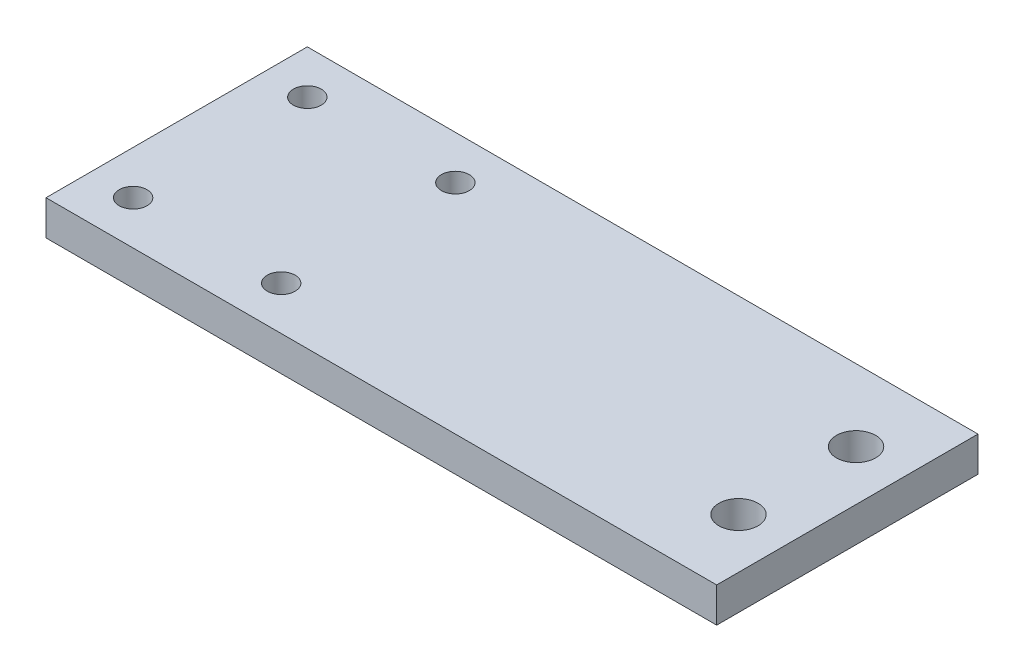
ISO-10303-21;
HEADER;
FILE_DESCRIPTION(('STEP AP214'),'2;1');
FILE_NAME('part.step','',(''),(''),'','','');
FILE_SCHEMA(('AUTOMOTIVE_DESIGN { 1 0 10303 214 1 1 1 1 }'));
ENDSEC;
DATA;
#1=APPLICATION_CONTEXT('core data for automotive mechanical design processes');
#2=APPLICATION_PROTOCOL_DEFINITION('international standard','automotive_design',2000,#1);
#3=PRODUCT_CONTEXT('',#1,'mechanical');
#4=PRODUCT('Part','Part','',(#3));
#5=PRODUCT_RELATED_PRODUCT_CATEGORY('part','',(#4));
#6=PRODUCT_DEFINITION_FORMATION('','',#4);
#7=PRODUCT_DEFINITION_CONTEXT('part definition',#1,'design');
#8=PRODUCT_DEFINITION('design','',#6,#7);
#9=PRODUCT_DEFINITION_SHAPE('','',#8);
#10=(LENGTH_UNIT() NAMED_UNIT(*) SI_UNIT(.MILLI.,.METRE.));
#11=(NAMED_UNIT(*) PLANE_ANGLE_UNIT() SI_UNIT($,.RADIAN.));
#12=(NAMED_UNIT(*) SI_UNIT($,.STERADIAN.) SOLID_ANGLE_UNIT());
#13=UNCERTAINTY_MEASURE_WITH_UNIT(LENGTH_MEASURE(1.E-05),#10,'distance_accuracy_value','');
#14=(GEOMETRIC_REPRESENTATION_CONTEXT(3) GLOBAL_UNCERTAINTY_ASSIGNED_CONTEXT((#13)) GLOBAL_UNIT_ASSIGNED_CONTEXT((#10,
#11,#12)) REPRESENTATION_CONTEXT('',''));
#15=CARTESIAN_POINT('',(0.,0.,0.));
#16=DIRECTION('',(0.,0.,1.));
#17=DIRECTION('',(1.,0.,0.));
#18=AXIS2_PLACEMENT_3D('',#15,#16,#17);
#19=CARTESIAN_POINT('',(0.,4.,0.));
#20=DIRECTION('',(0.,1.,0.));
#21=DIRECTION('',(0.,0.,1.));
#22=AXIS2_PLACEMENT_3D('',#19,#20,#21);
#23=PLANE('',#22);
#24=CARTESIAN_POINT('',(29.25,4.,-16.75));
#25=DIRECTION('',(0.,1.,0.));
#26=DIRECTION('',(0.,0.,1.));
#27=AXIS2_PLACEMENT_3D('',#24,#25,#26);
#28=CIRCLE('',#27,2.25);
#29=CARTESIAN_POINT('',(29.25,4.,-14.5));
#30=VERTEX_POINT('',#29);
#31=EDGE_CURVE('E162',#30,#30,#28,.T.);
#32=ORIENTED_EDGE('',*,*,#31,.F.);
#33=EDGE_LOOP('',(#32));
#34=FACE_BOUND('',#33,.T.);
#35=CARTESIAN_POINT('',(-20.,4.,0.));
#36=DIRECTION('',(0.,1.,0.));
#37=DIRECTION('',(0.,0.,-1.));
#38=AXIS2_PLACEMENT_3D('',#35,#36,#37);
#39=CIRCLE('',#38,1.6);
#40=CARTESIAN_POINT('',(-20.,4.,-1.6));
#41=VERTEX_POINT('',#40);
#42=EDGE_CURVE('E146',#41,#41,#39,.T.);
#43=ORIENTED_EDGE('',*,*,#42,.F.);
#44=EDGE_LOOP('',(#43));
#45=FACE_BOUND('',#44,.T.);
#46=CARTESIAN_POINT('',(-20.,4.,-20.));
#47=DIRECTION('',(0.,1.,0.));
#48=DIRECTION('',(0.,0.,1.));
#49=AXIS2_PLACEMENT_3D('',#46,#47,#48);
#50=CIRCLE('',#49,1.6);
#51=CARTESIAN_POINT('',(-20.,4.,-18.4));
#52=VERTEX_POINT('',#51);
#53=EDGE_CURVE('E116',#52,#52,#50,.T.);
#54=ORIENTED_EDGE('',*,*,#53,.F.);
#55=EDGE_LOOP('',(#54));
#56=FACE_BOUND('',#55,.T.);
#57=DIRECTION('',(-1.,0.,0.));
#58=VECTOR('',#57,1.);
#59=CARTESIAN_POINT('',(-42.,4.,-25.));
#60=LINE('',#59,#58);
#61=CARTESIAN_POINT('',(35.,4.,-25.));
#62=VERTEX_POINT('',#61);
#63=CARTESIAN_POINT('',(-42.,4.,-25.));
#64=VERTEX_POINT('',#63);
#65=EDGE_CURVE('E96',#62,#64,#60,.T.);
#66=ORIENTED_EDGE('',*,*,#65,.T.);
#67=DIRECTION('',(0.,0.,1.));
#68=VECTOR('',#67,1.);
#69=CARTESIAN_POINT('',(-42.,4.,4.99999999999999));
#70=LINE('',#69,#68);
#71=CARTESIAN_POINT('',(-42.,4.,4.99999999999999));
#72=VERTEX_POINT('',#71);
#73=EDGE_CURVE('E91',#64,#72,#70,.T.);
#74=ORIENTED_EDGE('',*,*,#73,.T.);
#75=DIRECTION('',(1.,0.,0.));
#76=VECTOR('',#75,1.);
#77=CARTESIAN_POINT('',(-42.,4.,4.99999999999999));
#78=LINE('',#77,#76);
#79=CARTESIAN_POINT('',(35.,4.,4.99999999999999));
#80=VERTEX_POINT('',#79);
#81=EDGE_CURVE('E94',#72,#80,#78,.T.);
#82=ORIENTED_EDGE('',*,*,#81,.T.);
#83=DIRECTION('',(0.,0.,-1.));
#84=VECTOR('',#83,1.);
#85=CARTESIAN_POINT('',(35.,4.,4.99999999999999));
#86=LINE('',#85,#84);
#87=EDGE_CURVE('E61',#80,#62,#86,.T.);
#88=ORIENTED_EDGE('',*,*,#87,.T.);
#89=EDGE_LOOP('',(#66,#74,#82,#88));
#90=FACE_BOUND('',#89,.T.);
#91=CARTESIAN_POINT('',(-37.,4.,-20.));
#92=DIRECTION('',(0.,1.,0.));
#93=DIRECTION('',(0.,0.,1.));
#94=AXIS2_PLACEMENT_3D('',#91,#92,#93);
#95=CIRCLE('',#94,1.6);
#96=CARTESIAN_POINT('',(-37.,4.,-18.4));
#97=VERTEX_POINT('',#96);
#98=EDGE_CURVE('E138',#97,#97,#95,.T.);
#99=ORIENTED_EDGE('',*,*,#98,.F.);
#100=EDGE_LOOP('',(#99));
#101=FACE_BOUND('',#100,.T.);
#102=CARTESIAN_POINT('',(-37.,4.,0.));
#103=DIRECTION('',(0.,1.,0.));
#104=DIRECTION('',(0.,0.,-1.));
#105=AXIS2_PLACEMENT_3D('',#102,#103,#104);
#106=CIRCLE('',#105,1.59999999999999);
#107=CARTESIAN_POINT('',(-37.,4.,-1.59999999999999));
#108=VERTEX_POINT('',#107);
#109=EDGE_CURVE('E154',#108,#108,#106,.T.);
#110=ORIENTED_EDGE('',*,*,#109,.F.);
#111=EDGE_LOOP('',(#110));
#112=FACE_BOUND('',#111,.T.);
#113=CARTESIAN_POINT('',(29.25,4.,-3.25000000000001));
#114=DIRECTION('',(0.,1.,0.));
#115=DIRECTION('',(0.,0.,-1.));
#116=AXIS2_PLACEMENT_3D('',#113,#114,#115);
#117=CIRCLE('',#116,2.25);
#118=CARTESIAN_POINT('',(29.25,4.,-5.5));
#119=VERTEX_POINT('',#118);
#120=EDGE_CURVE('E170',#119,#119,#117,.T.);
#121=ORIENTED_EDGE('',*,*,#120,.F.);
#122=EDGE_LOOP('',(#121));
#123=FACE_BOUND('',#122,.T.);
#124=ADVANCED_FACE('F43',(#34,#45,#56,#90,#101,#112,#123),#23,.T.);
#125=CARTESIAN_POINT('',(0.,0.,0.));
#126=DIRECTION('',(0.,1.,0.));
#127=DIRECTION('',(0.,0.,1.));
#128=AXIS2_PLACEMENT_3D('',#125,#126,#127);
#129=PLANE('',#128);
#130=DIRECTION('',(-1.,0.,0.));
#131=VECTOR('',#130,1.);
#132=CARTESIAN_POINT('',(-42.,0.,-25.));
#133=LINE('',#132,#131);
#134=CARTESIAN_POINT('',(35.,0.,-25.));
#135=VERTEX_POINT('',#134);
#136=CARTESIAN_POINT('',(-42.,0.,-25.));
#137=VERTEX_POINT('',#136);
#138=EDGE_CURVE('E112',#135,#137,#133,.T.);
#139=ORIENTED_EDGE('',*,*,#138,.F.);
#140=DIRECTION('',(0.,0.,-1.));
#141=VECTOR('',#140,1.);
#142=CARTESIAN_POINT('',(35.,0.,4.99999999999999));
#143=LINE('',#142,#141);
#144=CARTESIAN_POINT('',(35.,0.,4.99999999999999));
#145=VERTEX_POINT('',#144);
#146=EDGE_CURVE('E84',#145,#135,#143,.T.);
#147=ORIENTED_EDGE('',*,*,#146,.F.);
#148=DIRECTION('',(1.,0.,0.));
#149=VECTOR('',#148,1.);
#150=CARTESIAN_POINT('',(-42.,0.,4.99999999999999));
#151=LINE('',#150,#149);
#152=CARTESIAN_POINT('',(-42.,0.,4.99999999999999));
#153=VERTEX_POINT('',#152);
#154=EDGE_CURVE('E78',#153,#145,#151,.T.);
#155=ORIENTED_EDGE('',*,*,#154,.F.);
#156=DIRECTION('',(0.,0.,1.));
#157=VECTOR('',#156,1.);
#158=CARTESIAN_POINT('',(-42.,0.,4.99999999999999));
#159=LINE('',#158,#157);
#160=EDGE_CURVE('E101',#137,#153,#159,.T.);
#161=ORIENTED_EDGE('',*,*,#160,.F.);
#162=EDGE_LOOP('',(#139,#147,#155,#161));
#163=FACE_BOUND('',#162,.T.);
#164=CARTESIAN_POINT('',(-20.,0.,-20.));
#165=DIRECTION('',(0.,1.,0.));
#166=DIRECTION('',(0.,0.,1.));
#167=AXIS2_PLACEMENT_3D('',#164,#165,#166);
#168=CIRCLE('',#167,1.6);
#169=CARTESIAN_POINT('',(-20.,0.,-18.4));
#170=VERTEX_POINT('',#169);
#171=EDGE_CURVE('E134',#170,#170,#168,.T.);
#172=ORIENTED_EDGE('',*,*,#171,.T.);
#173=EDGE_LOOP('',(#172));
#174=FACE_BOUND('',#173,.T.);
#175=CARTESIAN_POINT('',(-37.,0.,-20.));
#176=DIRECTION('',(0.,1.,0.));
#177=DIRECTION('',(0.,0.,1.));
#178=AXIS2_PLACEMENT_3D('',#175,#176,#177);
#179=CIRCLE('',#178,1.6);
#180=CARTESIAN_POINT('',(-37.,0.,-18.4));
#181=VERTEX_POINT('',#180);
#182=EDGE_CURVE('E142',#181,#181,#179,.T.);
#183=ORIENTED_EDGE('',*,*,#182,.T.);
#184=EDGE_LOOP('',(#183));
#185=FACE_BOUND('',#184,.T.);
#186=CARTESIAN_POINT('',(-20.,0.,0.));
#187=DIRECTION('',(0.,1.,0.));
#188=DIRECTION('',(0.,0.,-1.));
#189=AXIS2_PLACEMENT_3D('',#186,#187,#188);
#190=CIRCLE('',#189,1.6);
#191=CARTESIAN_POINT('',(-20.,0.,-1.6));
#192=VERTEX_POINT('',#191);
#193=EDGE_CURVE('E150',#192,#192,#190,.T.);
#194=ORIENTED_EDGE('',*,*,#193,.T.);
#195=EDGE_LOOP('',(#194));
#196=FACE_BOUND('',#195,.T.);
#197=CARTESIAN_POINT('',(-37.,0.,0.));
#198=DIRECTION('',(0.,1.,0.));
#199=DIRECTION('',(0.,0.,-1.));
#200=AXIS2_PLACEMENT_3D('',#197,#198,#199);
#201=CIRCLE('',#200,1.59999999999999);
#202=CARTESIAN_POINT('',(-37.,0.,-1.59999999999999));
#203=VERTEX_POINT('',#202);
#204=EDGE_CURVE('E158',#203,#203,#201,.T.);
#205=ORIENTED_EDGE('',*,*,#204,.T.);
#206=EDGE_LOOP('',(#205));
#207=FACE_BOUND('',#206,.T.);
#208=CARTESIAN_POINT('',(29.25,0.,-16.75));
#209=DIRECTION('',(0.,1.,0.));
#210=DIRECTION('',(0.,0.,1.));
#211=AXIS2_PLACEMENT_3D('',#208,#209,#210);
#212=CIRCLE('',#211,2.25);
#213=CARTESIAN_POINT('',(29.25,0.,-14.5));
#214=VERTEX_POINT('',#213);
#215=EDGE_CURVE('E166',#214,#214,#212,.T.);
#216=ORIENTED_EDGE('',*,*,#215,.T.);
#217=EDGE_LOOP('',(#216));
#218=FACE_BOUND('',#217,.T.);
#219=CARTESIAN_POINT('',(29.25,0.,-3.25000000000001));
#220=DIRECTION('',(0.,1.,0.));
#221=DIRECTION('',(0.,0.,-1.));
#222=AXIS2_PLACEMENT_3D('',#219,#220,#221);
#223=CIRCLE('',#222,2.25);
#224=CARTESIAN_POINT('',(29.25,0.,-5.5));
#225=VERTEX_POINT('',#224);
#226=EDGE_CURVE('E174',#225,#225,#223,.T.);
#227=ORIENTED_EDGE('',*,*,#226,.T.);
#228=EDGE_LOOP('',(#227));
#229=FACE_BOUND('',#228,.T.);
#230=ADVANCED_FACE('F129',(#163,#174,#185,#196,#207,#218,#229),#129,.F.);
#231=CARTESIAN_POINT('',(-42.,4.,-25.));
#232=DIRECTION('',(0.,0.,1.));
#233=DIRECTION('',(1.,0.,0.));
#234=AXIS2_PLACEMENT_3D('',#231,#232,#233);
#235=PLANE('',#234);
#236=ORIENTED_EDGE('',*,*,#138,.T.);
#237=DIRECTION('',(0.,-1.,0.));
#238=VECTOR('',#237,1.);
#239=CARTESIAN_POINT('',(-42.,4.,-25.));
#240=LINE('',#239,#238);
#241=EDGE_CURVE('E11',#64,#137,#240,.T.);
#242=ORIENTED_EDGE('',*,*,#241,.F.);
#243=ORIENTED_EDGE('',*,*,#65,.F.);
#244=DIRECTION('',(0.,-1.,0.));
#245=VECTOR('',#244,1.);
#246=CARTESIAN_POINT('',(35.,4.,-25.));
#247=LINE('',#246,#245);
#248=EDGE_CURVE('E108',#62,#135,#247,.T.);
#249=ORIENTED_EDGE('',*,*,#248,.T.);
#250=EDGE_LOOP('',(#236,#242,#243,#249));
#251=FACE_BOUND('',#250,.T.);
#252=ADVANCED_FACE('F45',(#251),#235,.F.);
#253=CARTESIAN_POINT('',(-42.,4.,4.99999999999999));
#254=DIRECTION('',(1.,0.,0.));
#255=DIRECTION('',(0.,0.,-1.));
#256=AXIS2_PLACEMENT_3D('',#253,#254,#255);
#257=PLANE('',#256);
#258=ORIENTED_EDGE('',*,*,#160,.T.);
#259=DIRECTION('',(0.,-1.,0.));
#260=VECTOR('',#259,1.);
#261=CARTESIAN_POINT('',(-42.,4.,4.99999999999999));
#262=LINE('',#261,#260);
#263=EDGE_CURVE('E53',#72,#153,#262,.T.);
#264=ORIENTED_EDGE('',*,*,#263,.F.);
#265=ORIENTED_EDGE('',*,*,#73,.F.);
#266=ORIENTED_EDGE('',*,*,#241,.T.);
#267=EDGE_LOOP('',(#258,#264,#265,#266));
#268=FACE_BOUND('',#267,.T.);
#269=ADVANCED_FACE('F100',(#268),#257,.F.);
#270=CARTESIAN_POINT('',(-42.,4.,4.99999999999999));
#271=DIRECTION('',(0.,0.,-1.));
#272=DIRECTION('',(-1.,0.,0.));
#273=AXIS2_PLACEMENT_3D('',#270,#271,#272);
#274=PLANE('',#273);
#275=ORIENTED_EDGE('',*,*,#154,.T.);
#276=DIRECTION('',(0.,-1.,0.));
#277=VECTOR('',#276,1.);
#278=CARTESIAN_POINT('',(35.,4.,4.99999999999999));
#279=LINE('',#278,#277);
#280=EDGE_CURVE('E103',#80,#145,#279,.T.);
#281=ORIENTED_EDGE('',*,*,#280,.F.);
#282=ORIENTED_EDGE('',*,*,#81,.F.);
#283=ORIENTED_EDGE('',*,*,#263,.T.);
#284=EDGE_LOOP('',(#275,#281,#282,#283));
#285=FACE_BOUND('',#284,.T.);
#286=ADVANCED_FACE('F104',(#285),#274,.F.);
#287=CARTESIAN_POINT('',(35.,4.,4.99999999999999));
#288=DIRECTION('',(-1.,0.,0.));
#289=DIRECTION('',(0.,0.,1.));
#290=AXIS2_PLACEMENT_3D('',#287,#288,#289);
#291=PLANE('',#290);
#292=ORIENTED_EDGE('',*,*,#146,.T.);
#293=ORIENTED_EDGE('',*,*,#248,.F.);
#294=ORIENTED_EDGE('',*,*,#87,.F.);
#295=ORIENTED_EDGE('',*,*,#280,.T.);
#296=EDGE_LOOP('',(#292,#293,#294,#295));
#297=FACE_BOUND('',#296,.T.);
#298=ADVANCED_FACE('F126',(#297),#291,.F.);
#299=CARTESIAN_POINT('',(-20.,4.,-20.));
#300=DIRECTION('',(0.,-1.,0.));
#301=DIRECTION('',(0.,0.,-1.));
#302=AXIS2_PLACEMENT_3D('',#299,#300,#301);
#303=CYLINDRICAL_SURFACE('',#302,1.6);
#304=ORIENTED_EDGE('',*,*,#53,.T.);
#305=EDGE_LOOP('',(#304));
#306=FACE_BOUND('',#305,.T.);
#307=ORIENTED_EDGE('',*,*,#171,.F.);
#308=EDGE_LOOP('',(#307));
#309=FACE_BOUND('',#308,.T.);
#310=ADVANCED_FACE('F195',(#306,#309),#303,.F.);
#311=CARTESIAN_POINT('',(-37.,4.,-20.));
#312=DIRECTION('',(0.,-1.,0.));
#313=DIRECTION('',(0.,0.,-1.));
#314=AXIS2_PLACEMENT_3D('',#311,#312,#313);
#315=CYLINDRICAL_SURFACE('',#314,1.6);
#316=ORIENTED_EDGE('',*,*,#98,.T.);
#317=EDGE_LOOP('',(#316));
#318=FACE_BOUND('',#317,.T.);
#319=ORIENTED_EDGE('',*,*,#182,.F.);
#320=EDGE_LOOP('',(#319));
#321=FACE_BOUND('',#320,.T.);
#322=ADVANCED_FACE('F249',(#318,#321),#315,.F.);
#323=CARTESIAN_POINT('',(-20.,4.,0.));
#324=DIRECTION('',(0.,-1.,0.));
#325=DIRECTION('',(0.,0.,-1.));
#326=AXIS2_PLACEMENT_3D('',#323,#324,#325);
#327=CYLINDRICAL_SURFACE('',#326,1.6);
#328=ORIENTED_EDGE('',*,*,#42,.T.);
#329=EDGE_LOOP('',(#328));
#330=FACE_BOUND('',#329,.T.);
#331=ORIENTED_EDGE('',*,*,#193,.F.);
#332=EDGE_LOOP('',(#331));
#333=FACE_BOUND('',#332,.T.);
#334=ADVANCED_FACE('F258',(#330,#333),#327,.F.);
#335=CARTESIAN_POINT('',(-37.,4.,0.));
#336=DIRECTION('',(0.,-1.,0.));
#337=DIRECTION('',(0.,0.,-1.));
#338=AXIS2_PLACEMENT_3D('',#335,#336,#337);
#339=CYLINDRICAL_SURFACE('',#338,1.59999999999999);
#340=ORIENTED_EDGE('',*,*,#109,.T.);
#341=EDGE_LOOP('',(#340));
#342=FACE_BOUND('',#341,.T.);
#343=ORIENTED_EDGE('',*,*,#204,.F.);
#344=EDGE_LOOP('',(#343));
#345=FACE_BOUND('',#344,.T.);
#346=ADVANCED_FACE('F267',(#342,#345),#339,.F.);
#347=CARTESIAN_POINT('',(29.25,4.,-16.75));
#348=DIRECTION('',(0.,-1.,0.));
#349=DIRECTION('',(0.,0.,-1.));
#350=AXIS2_PLACEMENT_3D('',#347,#348,#349);
#351=CYLINDRICAL_SURFACE('',#350,2.25);
#352=ORIENTED_EDGE('',*,*,#31,.T.);
#353=EDGE_LOOP('',(#352));
#354=FACE_BOUND('',#353,.T.);
#355=ORIENTED_EDGE('',*,*,#215,.F.);
#356=EDGE_LOOP('',(#355));
#357=FACE_BOUND('',#356,.T.);
#358=ADVANCED_FACE('F277',(#354,#357),#351,.F.);
#359=CARTESIAN_POINT('',(29.25,4.,-3.25000000000001));
#360=DIRECTION('',(0.,-1.,0.));
#361=DIRECTION('',(0.,0.,-1.));
#362=AXIS2_PLACEMENT_3D('',#359,#360,#361);
#363=CYLINDRICAL_SURFACE('',#362,2.25);
#364=ORIENTED_EDGE('',*,*,#120,.T.);
#365=EDGE_LOOP('',(#364));
#366=FACE_BOUND('',#365,.T.);
#367=ORIENTED_EDGE('',*,*,#226,.F.);
#368=EDGE_LOOP('',(#367));
#369=FACE_BOUND('',#368,.T.);
#370=ADVANCED_FACE('F182',(#366,#369),#363,.F.);
#371=CLOSED_SHELL('',(#124,#230,#252,#269,#286,#298,#310,#322,#334,#346,#358,#370));
#372=MANIFOLD_SOLID_BREP('B2',#371);
#373=ADVANCED_BREP_SHAPE_REPRESENTATION('',(#18,#372),#14);
#374=SHAPE_DEFINITION_REPRESENTATION(#9,#373);
ENDSEC;
END-ISO-10303-21;
